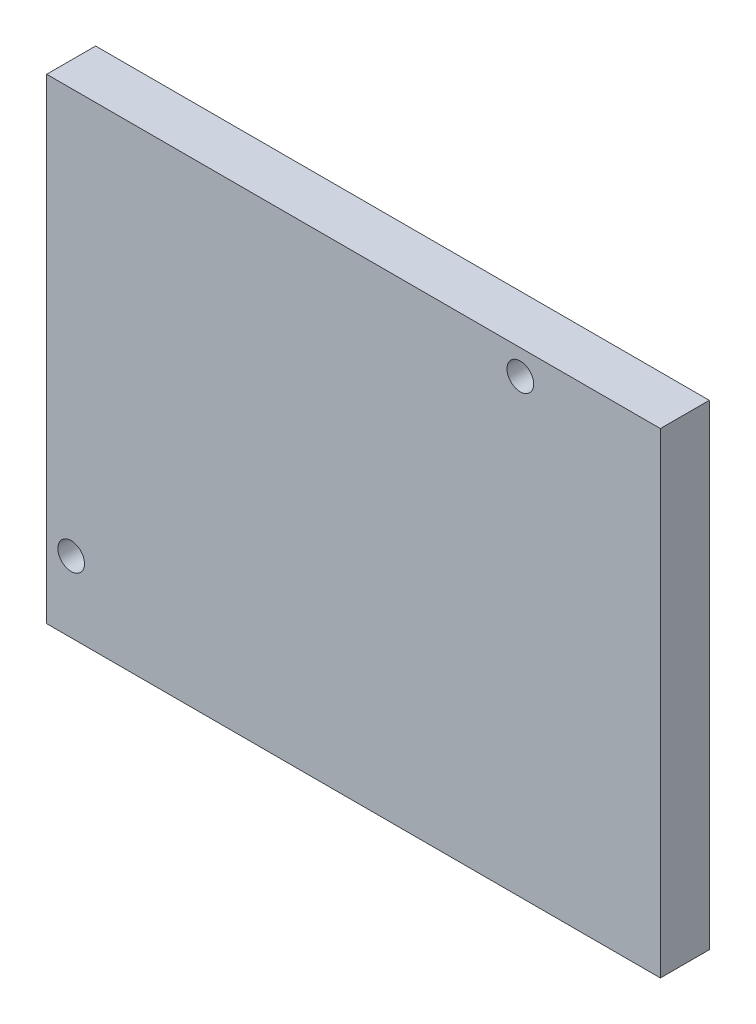
ISO-10303-21;
HEADER;
FILE_DESCRIPTION(('STEP AP214'),'2;1');
FILE_NAME('part.step','',(''),(''),'','','');
FILE_SCHEMA(('AUTOMOTIVE_DESIGN { 1 0 10303 214 1 1 1 1 }'));
ENDSEC;
DATA;
#1=APPLICATION_CONTEXT('core data for automotive mechanical design processes');
#2=APPLICATION_PROTOCOL_DEFINITION('international standard','automotive_design',2000,#1);
#3=PRODUCT_CONTEXT('',#1,'mechanical');
#4=PRODUCT('Part','Part','',(#3));
#5=PRODUCT_RELATED_PRODUCT_CATEGORY('part','',(#4));
#6=PRODUCT_DEFINITION_FORMATION('','',#4);
#7=PRODUCT_DEFINITION_CONTEXT('part definition',#1,'design');
#8=PRODUCT_DEFINITION('design','',#6,#7);
#9=PRODUCT_DEFINITION_SHAPE('','',#8);
#10=(LENGTH_UNIT() NAMED_UNIT(*) SI_UNIT(.MILLI.,.METRE.));
#11=(NAMED_UNIT(*) PLANE_ANGLE_UNIT() SI_UNIT($,.RADIAN.));
#12=(NAMED_UNIT(*) SI_UNIT($,.STERADIAN.) SOLID_ANGLE_UNIT());
#13=UNCERTAINTY_MEASURE_WITH_UNIT(LENGTH_MEASURE(1.E-05),#10,'distance_accuracy_value','');
#14=(GEOMETRIC_REPRESENTATION_CONTEXT(3) GLOBAL_UNCERTAINTY_ASSIGNED_CONTEXT((#13)) GLOBAL_UNIT_ASSIGNED_CONTEXT((#10,
#11,#12)) REPRESENTATION_CONTEXT('',''));
#15=CARTESIAN_POINT('',(0.,0.,0.));
#16=DIRECTION('',(0.,0.,1.));
#17=DIRECTION('',(1.,0.,0.));
#18=AXIS2_PLACEMENT_3D('',#15,#16,#17);
#19=CARTESIAN_POINT('',(34.5,26.75,5.5));
#20=DIRECTION('',(0.,0.,-1.));
#21=DIRECTION('',(-1.,0.,0.));
#22=AXIS2_PLACEMENT_3D('',#19,#20,#21);
#23=PLANE('',#22);
#24=CARTESIAN_POINT('',(18.75,23.95,5.5));
#25=DIRECTION('',(0.,0.,1.));
#26=DIRECTION('',(1.,0.,0.));
#27=AXIS2_PLACEMENT_3D('',#24,#25,#26);
#28=CIRCLE('',#27,1.5);
#29=CARTESIAN_POINT('',(20.25,23.95,5.5));
#30=VERTEX_POINT('',#29);
#31=EDGE_CURVE('E100',#30,#30,#28,.T.);
#32=ORIENTED_EDGE('',*,*,#31,.F.);
#33=EDGE_LOOP('',(#32));
#34=FACE_BOUND('',#33,.T.);
#35=DIRECTION('',(0.,1.,0.));
#36=VECTOR('',#35,1.);
#37=CARTESIAN_POINT('',(34.5,-26.75,5.5));
#38=LINE('',#37,#36);
#39=CARTESIAN_POINT('',(34.5,-26.75,5.5));
#40=VERTEX_POINT('',#39);
#41=CARTESIAN_POINT('',(34.5,26.75,5.5));
#42=VERTEX_POINT('',#41);
#43=EDGE_CURVE('E85',#40,#42,#38,.T.);
#44=ORIENTED_EDGE('',*,*,#43,.T.);
#45=DIRECTION('',(-1.,0.,0.));
#46=VECTOR('',#45,1.);
#47=CARTESIAN_POINT('',(-34.5,26.75,5.5));
#48=LINE('',#47,#46);
#49=CARTESIAN_POINT('',(-34.5,26.75,5.5));
#50=VERTEX_POINT('',#49);
#51=EDGE_CURVE('E80',#42,#50,#48,.T.);
#52=ORIENTED_EDGE('',*,*,#51,.T.);
#53=DIRECTION('',(0.,-1.,0.));
#54=VECTOR('',#53,1.);
#55=CARTESIAN_POINT('',(-34.5,-26.75,5.5));
#56=LINE('',#55,#54);
#57=CARTESIAN_POINT('',(-34.5,-26.75,5.5));
#58=VERTEX_POINT('',#57);
#59=EDGE_CURVE('E83',#50,#58,#56,.T.);
#60=ORIENTED_EDGE('',*,*,#59,.T.);
#61=DIRECTION('',(1.,0.,0.));
#62=VECTOR('',#61,1.);
#63=CARTESIAN_POINT('',(-34.5,-26.75,5.5));
#64=LINE('',#63,#62);
#65=EDGE_CURVE('E50',#58,#40,#64,.T.);
#66=ORIENTED_EDGE('',*,*,#65,.T.);
#67=EDGE_LOOP('',(#44,#52,#60,#66));
#68=FACE_BOUND('',#67,.T.);
#69=CARTESIAN_POINT('',(-31.75,-18.79,5.5));
#70=DIRECTION('',(0.,0.,1.));
#71=DIRECTION('',(1.,0.,0.));
#72=AXIS2_PLACEMENT_3D('',#69,#70,#71);
#73=CIRCLE('',#72,1.5);
#74=CARTESIAN_POINT('',(-30.25,-18.79,5.5));
#75=VERTEX_POINT('',#74);
#76=EDGE_CURVE('E115',#75,#75,#73,.T.);
#77=ORIENTED_EDGE('',*,*,#76,.F.);
#78=EDGE_LOOP('',(#77));
#79=FACE_BOUND('',#78,.T.);
#80=ADVANCED_FACE('F33',(#34,#68,#79),#23,.F.);
#81=CARTESIAN_POINT('',(34.5,26.75,0.));
#82=DIRECTION('',(0.,0.,-1.));
#83=DIRECTION('',(-1.,0.,0.));
#84=AXIS2_PLACEMENT_3D('',#81,#82,#83);
#85=PLANE('',#84);
#86=CARTESIAN_POINT('',(18.75,23.95,0.));
#87=DIRECTION('',(0.,0.,1.));
#88=DIRECTION('',(1.,0.,0.));
#89=AXIS2_PLACEMENT_3D('',#86,#87,#88);
#90=CIRCLE('',#89,1.5);
#91=CARTESIAN_POINT('',(20.25,23.95,0.));
#92=VERTEX_POINT('',#91);
#93=EDGE_CURVE('E112',#92,#92,#90,.T.);
#94=ORIENTED_EDGE('',*,*,#93,.T.);
#95=EDGE_LOOP('',(#94));
#96=FACE_BOUND('',#95,.T.);
#97=DIRECTION('',(0.,1.,0.));
#98=VECTOR('',#97,1.);
#99=CARTESIAN_POINT('',(34.5,-26.75,0.));
#100=LINE('',#99,#98);
#101=CARTESIAN_POINT('',(34.5,-26.75,0.));
#102=VERTEX_POINT('',#101);
#103=CARTESIAN_POINT('',(34.5,26.75,0.));
#104=VERTEX_POINT('',#103);
#105=EDGE_CURVE('E97',#102,#104,#100,.T.);
#106=ORIENTED_EDGE('',*,*,#105,.F.);
#107=DIRECTION('',(1.,0.,0.));
#108=VECTOR('',#107,1.);
#109=CARTESIAN_POINT('',(-34.5,-26.75,0.));
#110=LINE('',#109,#108);
#111=CARTESIAN_POINT('',(-34.5,-26.75,0.));
#112=VERTEX_POINT('',#111);
#113=EDGE_CURVE('E73',#112,#102,#110,.T.);
#114=ORIENTED_EDGE('',*,*,#113,.F.);
#115=DIRECTION('',(0.,-1.,0.));
#116=VECTOR('',#115,1.);
#117=CARTESIAN_POINT('',(-34.5,-26.75,0.));
#118=LINE('',#117,#116);
#119=CARTESIAN_POINT('',(-34.5,26.75,0.));
#120=VERTEX_POINT('',#119);
#121=EDGE_CURVE('E67',#120,#112,#118,.T.);
#122=ORIENTED_EDGE('',*,*,#121,.F.);
#123=DIRECTION('',(-1.,0.,0.));
#124=VECTOR('',#123,1.);
#125=CARTESIAN_POINT('',(-34.5,26.75,0.));
#126=LINE('',#125,#124);
#127=EDGE_CURVE('E89',#104,#120,#126,.T.);
#128=ORIENTED_EDGE('',*,*,#127,.F.);
#129=EDGE_LOOP('',(#106,#114,#122,#128));
#130=FACE_BOUND('',#129,.T.);
#131=CARTESIAN_POINT('',(-31.75,-18.79,0.));
#132=DIRECTION('',(0.,0.,1.));
#133=DIRECTION('',(1.,0.,0.));
#134=AXIS2_PLACEMENT_3D('',#131,#132,#133);
#135=CIRCLE('',#134,1.5);
#136=CARTESIAN_POINT('',(-30.25,-18.79,0.));
#137=VERTEX_POINT('',#136);
#138=EDGE_CURVE('E118',#137,#137,#135,.T.);
#139=ORIENTED_EDGE('',*,*,#138,.T.);
#140=EDGE_LOOP('',(#139));
#141=FACE_BOUND('',#140,.T.);
#142=ADVANCED_FACE('F108',(#96,#130,#141),#85,.T.);
#143=CARTESIAN_POINT('',(34.5,-26.75,5.5));
#144=DIRECTION('',(-1.,0.,0.));
#145=DIRECTION('',(0.,0.,1.));
#146=AXIS2_PLACEMENT_3D('',#143,#144,#145);
#147=PLANE('',#146);
#148=ORIENTED_EDGE('',*,*,#105,.T.);
#149=DIRECTION('',(0.,0.,-1.));
#150=VECTOR('',#149,1.);
#151=CARTESIAN_POINT('',(34.5,26.75,5.5));
#152=LINE('',#151,#150);
#153=EDGE_CURVE('E11',#42,#104,#152,.T.);
#154=ORIENTED_EDGE('',*,*,#153,.F.);
#155=ORIENTED_EDGE('',*,*,#43,.F.);
#156=DIRECTION('',(0.,0.,-1.));
#157=VECTOR('',#156,1.);
#158=CARTESIAN_POINT('',(34.5,-26.75,5.5));
#159=LINE('',#158,#157);
#160=EDGE_CURVE('E93',#40,#102,#159,.T.);
#161=ORIENTED_EDGE('',*,*,#160,.T.);
#162=EDGE_LOOP('',(#148,#154,#155,#161));
#163=FACE_BOUND('',#162,.T.);
#164=ADVANCED_FACE('F35',(#163),#147,.F.);
#165=CARTESIAN_POINT('',(-34.5,26.75,5.5));
#166=DIRECTION('',(0.,-1.,0.));
#167=DIRECTION('',(0.,0.,-1.));
#168=AXIS2_PLACEMENT_3D('',#165,#166,#167);
#169=PLANE('',#168);
#170=ORIENTED_EDGE('',*,*,#127,.T.);
#171=DIRECTION('',(0.,0.,-1.));
#172=VECTOR('',#171,1.);
#173=CARTESIAN_POINT('',(-34.5,26.75,5.5));
#174=LINE('',#173,#172);
#175=EDGE_CURVE('E42',#50,#120,#174,.T.);
#176=ORIENTED_EDGE('',*,*,#175,.F.);
#177=ORIENTED_EDGE('',*,*,#51,.F.);
#178=ORIENTED_EDGE('',*,*,#153,.T.);
#179=EDGE_LOOP('',(#170,#176,#177,#178));
#180=FACE_BOUND('',#179,.T.);
#181=ADVANCED_FACE('F88',(#180),#169,.F.);
#182=CARTESIAN_POINT('',(-34.5,-26.75,5.5));
#183=DIRECTION('',(1.,0.,0.));
#184=DIRECTION('',(0.,0.,-1.));
#185=AXIS2_PLACEMENT_3D('',#182,#183,#184);
#186=PLANE('',#185);
#187=ORIENTED_EDGE('',*,*,#121,.T.);
#188=DIRECTION('',(0.,0.,-1.));
#189=VECTOR('',#188,1.);
#190=CARTESIAN_POINT('',(-34.5,-26.75,5.5));
#191=LINE('',#190,#189);
#192=EDGE_CURVE('E90',#58,#112,#191,.T.);
#193=ORIENTED_EDGE('',*,*,#192,.F.);
#194=ORIENTED_EDGE('',*,*,#59,.F.);
#195=ORIENTED_EDGE('',*,*,#175,.T.);
#196=EDGE_LOOP('',(#187,#193,#194,#195));
#197=FACE_BOUND('',#196,.T.);
#198=ADVANCED_FACE('F91',(#197),#186,.F.);
#199=CARTESIAN_POINT('',(-34.5,-26.75,5.5));
#200=DIRECTION('',(0.,1.,0.));
#201=DIRECTION('',(0.,0.,1.));
#202=AXIS2_PLACEMENT_3D('',#199,#200,#201);
#203=PLANE('',#202);
#204=ORIENTED_EDGE('',*,*,#113,.T.);
#205=ORIENTED_EDGE('',*,*,#160,.F.);
#206=ORIENTED_EDGE('',*,*,#65,.F.);
#207=ORIENTED_EDGE('',*,*,#192,.T.);
#208=EDGE_LOOP('',(#204,#205,#206,#207));
#209=FACE_BOUND('',#208,.T.);
#210=ADVANCED_FACE('F105',(#209),#203,.F.);
#211=CARTESIAN_POINT('',(18.75,23.95,5.5));
#212=DIRECTION('',(0.,0.,-1.));
#213=DIRECTION('',(-1.,0.,0.));
#214=AXIS2_PLACEMENT_3D('',#211,#212,#213);
#215=CYLINDRICAL_SURFACE('',#214,1.5);
#216=ORIENTED_EDGE('',*,*,#31,.T.);
#217=EDGE_LOOP('',(#216));
#218=FACE_BOUND('',#217,.T.);
#219=ORIENTED_EDGE('',*,*,#93,.F.);
#220=EDGE_LOOP('',(#219));
#221=FACE_BOUND('',#220,.T.);
#222=ADVANCED_FACE('F136',(#218,#221),#215,.F.);
#223=CARTESIAN_POINT('',(-31.75,-18.79,5.5));
#224=DIRECTION('',(0.,0.,-1.));
#225=DIRECTION('',(-1.,0.,0.));
#226=AXIS2_PLACEMENT_3D('',#223,#224,#225);
#227=CYLINDRICAL_SURFACE('',#226,1.5);
#228=ORIENTED_EDGE('',*,*,#76,.T.);
#229=EDGE_LOOP('',(#228));
#230=FACE_BOUND('',#229,.T.);
#231=ORIENTED_EDGE('',*,*,#138,.F.);
#232=EDGE_LOOP('',(#231));
#233=FACE_BOUND('',#232,.T.);
#234=ADVANCED_FACE('F124',(#230,#233),#227,.F.);
#235=CLOSED_SHELL('',(#80,#142,#164,#181,#198,#210,#222,#234));
#236=MANIFOLD_SOLID_BREP('B2',#235);
#237=ADVANCED_BREP_SHAPE_REPRESENTATION('',(#18,#236),#14);
#238=SHAPE_DEFINITION_REPRESENTATION(#9,#237);
ENDSEC;
END-ISO-10303-21;
